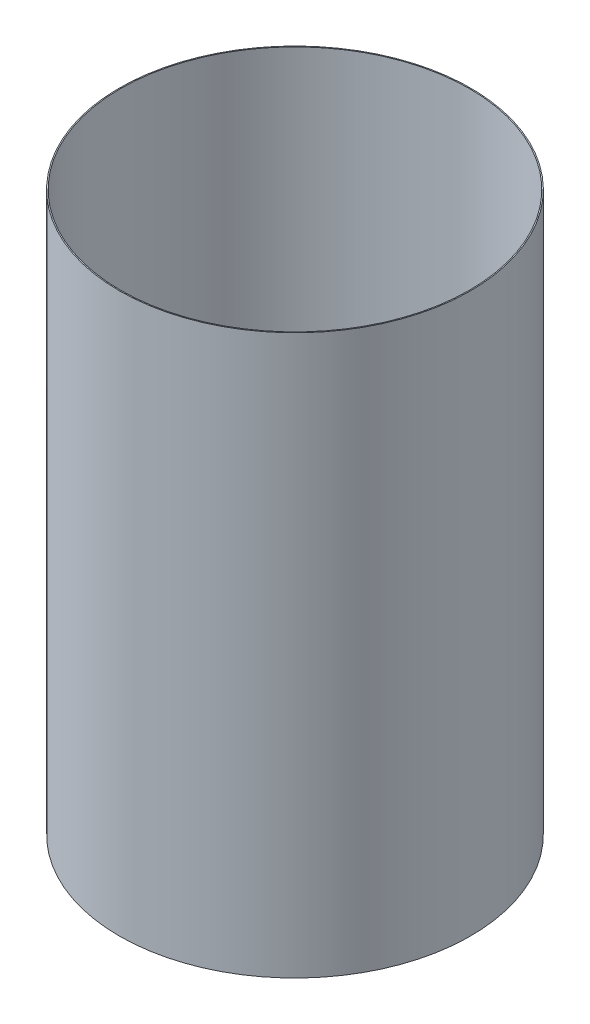
ISO-10303-21;
HEADER;
FILE_DESCRIPTION(('STEP AP214'),'2;1');
FILE_NAME('part.step','',(''),(''),'','','');
FILE_SCHEMA(('AUTOMOTIVE_DESIGN { 1 0 10303 214 1 1 1 1 }'));
ENDSEC;
DATA;
#1=APPLICATION_CONTEXT('core data for automotive mechanical design processes');
#2=APPLICATION_PROTOCOL_DEFINITION('international standard','automotive_design',2000,#1);
#3=PRODUCT_CONTEXT('',#1,'mechanical');
#4=PRODUCT('Part','Part','',(#3));
#5=PRODUCT_RELATED_PRODUCT_CATEGORY('part','',(#4));
#6=PRODUCT_DEFINITION_FORMATION('','',#4);
#7=PRODUCT_DEFINITION_CONTEXT('part definition',#1,'design');
#8=PRODUCT_DEFINITION('design','',#6,#7);
#9=PRODUCT_DEFINITION_SHAPE('','',#8);
#10=(LENGTH_UNIT() NAMED_UNIT(*) SI_UNIT(.MILLI.,.METRE.));
#11=(NAMED_UNIT(*) PLANE_ANGLE_UNIT() SI_UNIT($,.RADIAN.));
#12=(NAMED_UNIT(*) SI_UNIT($,.STERADIAN.) SOLID_ANGLE_UNIT());
#13=UNCERTAINTY_MEASURE_WITH_UNIT(LENGTH_MEASURE(1.E-05),#10,'distance_accuracy_value','');
#14=(GEOMETRIC_REPRESENTATION_CONTEXT(3) GLOBAL_UNCERTAINTY_ASSIGNED_CONTEXT((#13)) GLOBAL_UNIT_ASSIGNED_CONTEXT((#10,
#11,#12)) REPRESENTATION_CONTEXT('',''));
#15=CARTESIAN_POINT('',(0.,0.,0.));
#16=DIRECTION('',(0.,0.,1.));
#17=DIRECTION('',(1.,0.,0.));
#18=AXIS2_PLACEMENT_3D('',#15,#16,#17);
#19=CARTESIAN_POINT('',(0.,55.,0.));
#20=DIRECTION('',(0.,1.,0.));
#21=DIRECTION('',(0.,0.,1.));
#22=AXIS2_PLACEMENT_3D('',#19,#20,#21);
#23=CYLINDRICAL_SURFACE('',#22,41.91);
#24=CARTESIAN_POINT('',(0.,-202.353193409573,0.));
#25=DIRECTION('',(0.,1.,0.));
#26=DIRECTION('',(0.,0.,1.));
#27=AXIS2_PLACEMENT_3D('',#24,#25,#26);
#28=CIRCLE('',#27,41.91);
#29=CARTESIAN_POINT('',(0.,-202.353193409573,41.91));
#30=VERTEX_POINT('',#29);
#31=EDGE_CURVE('E44',#30,#30,#28,.T.);
#32=ORIENTED_EDGE('',*,*,#31,.T.);
#33=EDGE_LOOP('',(#32));
#34=FACE_BOUND('',#33,.T.);
#35=CARTESIAN_POINT('',(0.,-69.0031934095732,0.));
#36=DIRECTION('',(0.,1.,0.));
#37=DIRECTION('',(0.,0.,1.));
#38=AXIS2_PLACEMENT_3D('',#35,#36,#37);
#39=CIRCLE('',#38,41.91);
#40=CARTESIAN_POINT('',(0.,-69.0031934095732,41.91));
#41=VERTEX_POINT('',#40);
#42=EDGE_CURVE('E10',#41,#41,#39,.T.);
#43=ORIENTED_EDGE('',*,*,#42,.F.);
#44=EDGE_LOOP('',(#43));
#45=FACE_BOUND('',#44,.T.);
#46=ADVANCED_FACE('F30',(#34,#45),#23,.T.);
#47=CARTESIAN_POINT('',(-41.91,-69.0031934095732,0.));
#48=DIRECTION('',(0.,-1.,0.));
#49=DIRECTION('',(0.,0.,-1.));
#50=AXIS2_PLACEMENT_3D('',#47,#48,#49);
#51=PLANE('',#50);
#52=CARTESIAN_POINT('',(0.,-69.0031934095732,0.));
#53=DIRECTION('',(0.,1.,0.));
#54=DIRECTION('',(0.,0.,1.));
#55=AXIS2_PLACEMENT_3D('',#52,#53,#54);
#56=CIRCLE('',#55,41.656);
#57=CARTESIAN_POINT('',(0.,-69.0031934095732,41.656));
#58=VERTEX_POINT('',#57);
#59=EDGE_CURVE('E36',#58,#58,#56,.T.);
#60=ORIENTED_EDGE('',*,*,#59,.F.);
#61=EDGE_LOOP('',(#60));
#62=FACE_BOUND('',#61,.T.);
#63=ORIENTED_EDGE('',*,*,#42,.T.);
#64=EDGE_LOOP('',(#63));
#65=FACE_BOUND('',#64,.T.);
#66=ADVANCED_FACE('F60',(#62,#65),#51,.F.);
#67=CARTESIAN_POINT('',(0.,55.,0.));
#68=DIRECTION('',(0.,1.,0.));
#69=DIRECTION('',(0.,0.,1.));
#70=AXIS2_PLACEMENT_3D('',#67,#68,#69);
#71=CYLINDRICAL_SURFACE('',#70,41.656);
#72=CARTESIAN_POINT('',(0.,-202.353193409573,0.));
#73=DIRECTION('',(0.,1.,0.));
#74=DIRECTION('',(0.,0.,1.));
#75=AXIS2_PLACEMENT_3D('',#72,#73,#74);
#76=CIRCLE('',#75,41.656);
#77=CARTESIAN_POINT('',(0.,-202.353193409573,41.656));
#78=VERTEX_POINT('',#77);
#79=EDGE_CURVE('E40',#78,#78,#76,.T.);
#80=ORIENTED_EDGE('',*,*,#79,.F.);
#81=EDGE_LOOP('',(#80));
#82=FACE_BOUND('',#81,.T.);
#83=ORIENTED_EDGE('',*,*,#59,.T.);
#84=EDGE_LOOP('',(#83));
#85=FACE_BOUND('',#84,.T.);
#86=ADVANCED_FACE('F55',(#82,#85),#71,.F.);
#87=CARTESIAN_POINT('',(-41.656,-202.353193409573,0.));
#88=DIRECTION('',(0.,1.,0.));
#89=DIRECTION('',(0.,0.,1.));
#90=AXIS2_PLACEMENT_3D('',#87,#88,#89);
#91=PLANE('',#90);
#92=ORIENTED_EDGE('',*,*,#31,.F.);
#93=EDGE_LOOP('',(#92));
#94=FACE_BOUND('',#93,.T.);
#95=ORIENTED_EDGE('',*,*,#79,.T.);
#96=EDGE_LOOP('',(#95));
#97=FACE_BOUND('',#96,.T.);
#98=ADVANCED_FACE('F52',(#94,#97),#91,.F.);
#99=CLOSED_SHELL('',(#46,#66,#86,#98));
#100=MANIFOLD_SOLID_BREP('B2',#99);
#101=ADVANCED_BREP_SHAPE_REPRESENTATION('',(#18,#100),#14);
#102=SHAPE_DEFINITION_REPRESENTATION(#9,#101);
ENDSEC;
END-ISO-10303-21;
